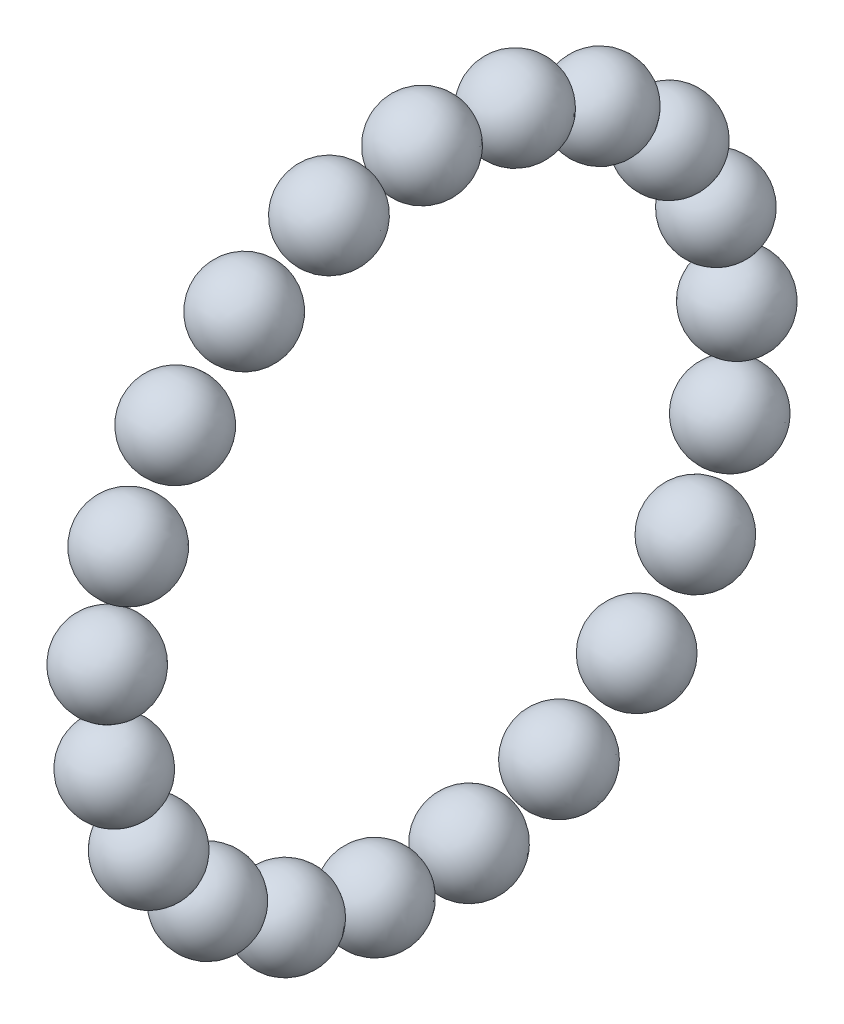
ISO-10303-21;
HEADER;
FILE_DESCRIPTION(('STEP AP214'),'2;1');
FILE_NAME('part.step','',(''),(''),'','','');
FILE_SCHEMA(('AUTOMOTIVE_DESIGN { 1 0 10303 214 1 1 1 1 }'));
ENDSEC;
DATA;
#1=APPLICATION_CONTEXT('core data for automotive mechanical design processes');
#2=APPLICATION_PROTOCOL_DEFINITION('international standard','automotive_design',2000,#1);
#3=PRODUCT_CONTEXT('',#1,'mechanical');
#4=PRODUCT('Part','Part','',(#3));
#5=PRODUCT_RELATED_PRODUCT_CATEGORY('part','',(#4));
#6=PRODUCT_DEFINITION_FORMATION('','',#4);
#7=PRODUCT_DEFINITION_CONTEXT('part definition',#1,'design');
#8=PRODUCT_DEFINITION('design','',#6,#7);
#9=PRODUCT_DEFINITION_SHAPE('','',#8);
#10=(LENGTH_UNIT() NAMED_UNIT(*) SI_UNIT(.MILLI.,.METRE.));
#11=(NAMED_UNIT(*) PLANE_ANGLE_UNIT() SI_UNIT($,.RADIAN.));
#12=(NAMED_UNIT(*) SI_UNIT($,.STERADIAN.) SOLID_ANGLE_UNIT());
#13=UNCERTAINTY_MEASURE_WITH_UNIT(LENGTH_MEASURE(1.E-05),#10,'distance_accuracy_value','');
#14=(GEOMETRIC_REPRESENTATION_CONTEXT(3) GLOBAL_UNCERTAINTY_ASSIGNED_CONTEXT((#13)) GLOBAL_UNIT_ASSIGNED_CONTEXT((#10,
#11,#12)) REPRESENTATION_CONTEXT('',''));
#15=CARTESIAN_POINT('',(0.,0.,0.));
#16=DIRECTION('',(0.,0.,1.));
#17=DIRECTION('',(1.,0.,0.));
#18=AXIS2_PLACEMENT_3D('',#15,#16,#17);
#19=CARTESIAN_POINT('',(0.,12.8067010018979,-8.73146089998614));
#20=DIRECTION('',(0.,0.563320058063622,0.826238774315995));
#21=DIRECTION('',(1.,0.,0.));
#22=AXIS2_PLACEMENT_3D('',#19,#20,#21);
#23=SPHERICAL_SURFACE('',#22,2.1);
#24=CARTESIAN_POINT('',(0.,13.9896731238315,-6.99635947392255));
#25=VERTEX_POINT('',#24);
#26=VERTEX_LOOP('',#25);
#27=FACE_BOUND('',#26,.T.);
#28=ADVANCED_FACE('F13',(#27),#23,.T.);
#29=CLOSED_SHELL('',(#28));
#30=MANIFOLD_SOLID_BREP('B1',#29);
#31=CARTESIAN_POINT('',(0.,5.66278587767913,-14.4285431039852));
#32=DIRECTION('',(0.,0.930873748644204,0.365341024366396));
#33=DIRECTION('',(1.,0.,0.));
#34=AXIS2_PLACEMENT_3D('',#31,#32,#33);
#35=SPHERICAL_SURFACE('',#34,2.1);
#36=CARTESIAN_POINT('',(0.,7.61762074983196,-13.6613269528157));
#37=VERTEX_POINT('',#36);
#38=VERTEX_LOOP('',#37);
#39=FACE_BOUND('',#38,.T.);
#40=ADVANCED_FACE('F21',(#39),#35,.T.);
#41=CLOSED_SHELL('',(#40));
#42=MANIFOLD_SOLID_BREP('B1',#41);
#43=CARTESIAN_POINT('',(0.,-3.44907447632288,-15.1113826388182));
#44=DIRECTION('',(0.,0.974927912181824,-0.222520933956315));
#45=DIRECTION('',(1.,0.,0.));
#46=AXIS2_PLACEMENT_3D('',#43,#44,#45);
#47=SPHERICAL_SURFACE('',#46,2.1);
#48=CARTESIAN_POINT('',(0.,-1.40172586074104,-15.5786766001265));
#49=VERTEX_POINT('',#48);
#50=VERTEX_LOOP('',#49);
#51=FACE_BOUND('',#50,.T.);
#52=ADVANCED_FACE('F31',(#51),#47,.T.);
#53=CLOSED_SHELL('',(#52));
#54=MANIFOLD_SOLID_BREP('B1',#53);
#55=CARTESIAN_POINT('',(0.,-11.3623040133623,-10.5426774354492));
#56=DIRECTION('',(0.,0.68017273777092,-0.733051871829826));
#57=DIRECTION('',(1.,0.,0.));
#58=AXIS2_PLACEMENT_3D('',#55,#56,#57);
#59=SPHERICAL_SURFACE('',#58,2.1);
#60=CARTESIAN_POINT('',(0.,-9.93394126404337,-12.0820863662919));
#61=VERTEX_POINT('',#60);
#62=VERTEX_LOOP('',#61);
#63=FACE_BOUND('',#62,.T.);
#64=ADVANCED_FACE('F35',(#63),#59,.T.);
#65=CLOSED_SHELL('',(#64));
#66=MANIFOLD_SOLID_BREP('B1',#65);
#67=CARTESIAN_POINT('',(0.,-15.3268778064895,-2.3101551257307));
#68=DIRECTION('',(0.,0.149042266176174,-0.988830826225129));
#69=DIRECTION('',(1.,0.,0.));
#70=AXIS2_PLACEMENT_3D('',#67,#68,#69);
#71=SPHERICAL_SURFACE('',#70,2.1);
#72=CARTESIAN_POINT('',(0.,-15.0138890475195,-4.38669986080348));
#73=VERTEX_POINT('',#72);
#74=VERTEX_LOOP('',#73);
#75=FACE_BOUND('',#74,.T.);
#76=ADVANCED_FACE('F40',(#75),#71,.T.);
#77=CLOSED_SHELL('',(#76));
#78=MANIFOLD_SOLID_BREP('B1',#77);
#79=CARTESIAN_POINT('',(0.,-13.9650174524875,6.72519795632215));
#80=DIRECTION('',(0.,-0.433883739117559,-0.900968867902419));
#81=DIRECTION('',(1.,0.,0.));
#82=AXIS2_PLACEMENT_3D('',#79,#80,#81);
#83=SPHERICAL_SURFACE('',#82,2.1);
#84=CARTESIAN_POINT('',(0.,-14.8761733046344,4.83316333372707));
#85=VERTEX_POINT('',#84);
#86=VERTEX_LOOP('',#85);
#87=FACE_BOUND('',#86,.T.);
#88=ADVANCED_FACE('F45',(#87),#83,.T.);
#89=CLOSED_SHELL('',(#88));
#90=MANIFOLD_SOLID_BREP('B1',#89);
#91=CARTESIAN_POINT('',(0.,-7.75,13.4233937586588));
#92=DIRECTION('',(0.,-0.866025403784439,-0.5));
#93=DIRECTION('',(1.,0.,0.));
#94=AXIS2_PLACEMENT_3D('',#91,#92,#93);
#95=SPHERICAL_SURFACE('',#94,2.1);
#96=CARTESIAN_POINT('',(0.,-9.56865334794732,12.3733937586588));
#97=VERTEX_POINT('',#96);
#98=VERTEX_LOOP('',#97);
#99=FACE_BOUND('',#98,.T.);
#100=ADVANCED_FACE('F50',(#99),#95,.T.);
#101=CLOSED_SHELL('',(#100));
#102=MANIFOLD_SOLID_BREP('B1',#101);
#103=CARTESIAN_POINT('',(0.,1.15831645058957,15.4566588563083));
#104=DIRECTION('',(0.,-0.99720379718118,0.0747300935864242));
#105=DIRECTION('',(1.,0.,0.));
#106=AXIS2_PLACEMENT_3D('',#103,#104,#105);
#107=SPHERICAL_SURFACE('',#106,2.1);
#108=CARTESIAN_POINT('',(0.,-0.935811523490904,15.6135920528398));
#109=VERTEX_POINT('',#108);
#110=VERTEX_LOOP('',#109);
#111=FACE_BOUND('',#110,.T.);
#112=ADVANCED_FACE('F55',(#111),#107,.T.);
#113=CLOSED_SHELL('',(#112));
#114=MANIFOLD_SOLID_BREP('B1',#113);
#115=CARTESIAN_POINT('',(0.,9.66409192881037,12.1183879782545));
#116=DIRECTION('',(0.,-0.78183148246803,0.623489801858734));
#117=DIRECTION('',(1.,0.,0.));
#118=AXIS2_PLACEMENT_3D('',#115,#116,#117);
#119=SPHERICAL_SURFACE('',#118,2.1);
#120=CARTESIAN_POINT('',(0.,8.02224581562751,13.4277165621578));
#121=VERTEX_POINT('',#120);
#122=VERTEX_LOOP('',#121);
#123=FACE_BOUND('',#122,.T.);
#124=ADVANCED_FACE('F60',(#123),#119,.T.);
#125=CLOSED_SHELL('',(#124));
#126=MANIFOLD_SOLID_BREP('B1',#125);
#127=CARTESIAN_POINT('',(0.,14.8113784896852,4.56870520336901));
#128=DIRECTION('',(0.,-0.294755174410904,0.955572805786141));
#129=DIRECTION('',(1.,0.,0.));
#130=AXIS2_PLACEMENT_3D('',#127,#128,#129);
#131=SPHERICAL_SURFACE('',#130,2.1);
#132=CARTESIAN_POINT('',(0.,14.1923926234223,6.57540809551991));
#133=VERTEX_POINT('',#132);
#134=VERTEX_LOOP('',#133);
#135=FACE_BOUND('',#134,.T.);
#136=ADVANCED_FACE('F65',(#135),#131,.T.);
#137=CLOSED_SHELL('',(#136));
#138=MANIFOLD_SOLID_BREP('B1',#137);
#139=CARTESIAN_POINT('',(0.,0.,0.));
#140=DIRECTION('',(0.,0.,1.));
#141=DIRECTION('',(1.,0.,0.));
#142=AXIS2_PLACEMENT_3D('',#139,#140,#141);
#143=SPHERICAL_SURFACE('',#142,0.005);
#144=CARTESIAN_POINT('',(0.,0.,0.005));
#145=VERTEX_POINT('',#144);
#146=VERTEX_LOOP('',#145);
#147=FACE_BOUND('',#146,.T.);
#148=ADVANCED_FACE('F70',(#147),#143,.T.);
#149=CLOSED_SHELL('',(#148));
#150=MANIFOLD_SOLID_BREP('B1',#149);
#151=CARTESIAN_POINT('',(0.,15.5,0.));
#152=DIRECTION('',(0.,0.,1.));
#153=DIRECTION('',(1.,0.,0.));
#154=AXIS2_PLACEMENT_3D('',#151,#152,#153);
#155=SPHERICAL_SURFACE('',#154,2.1);
#156=CARTESIAN_POINT('',(0.,15.5,2.1));
#157=VERTEX_POINT('',#156);
#158=VERTEX_LOOP('',#157);
#159=FACE_BOUND('',#158,.T.);
#160=ADVANCED_FACE('F75',(#159),#155,.T.);
#161=CLOSED_SHELL('',(#160));
#162=MANIFOLD_SOLID_BREP('B1',#161);
#163=CARTESIAN_POINT('',(0.,12.8067010018979,8.73146089998614));
#164=DIRECTION('',(0.,-0.563320058063622,0.826238774315995));
#165=DIRECTION('',(1.,0.,0.));
#166=AXIS2_PLACEMENT_3D('',#163,#164,#165);
#167=SPHERICAL_SURFACE('',#166,2.1);
#168=CARTESIAN_POINT('',(0.,11.6237288799643,10.4665623260497));
#169=VERTEX_POINT('',#168);
#170=VERTEX_LOOP('',#169);
#171=FACE_BOUND('',#170,.T.);
#172=ADVANCED_FACE('F80',(#171),#167,.T.);
#173=CLOSED_SHELL('',(#172));
#174=MANIFOLD_SOLID_BREP('B1',#173);
#175=CARTESIAN_POINT('',(0.,5.66278587767912,14.4285431039852));
#176=DIRECTION('',(0.,-0.930873748644204,0.365341024366395));
#177=DIRECTION('',(1.,0.,0.));
#178=AXIS2_PLACEMENT_3D('',#175,#176,#177);
#179=SPHERICAL_SURFACE('',#178,2.1);
#180=CARTESIAN_POINT('',(0.,3.70795100552629,15.1957592551546));
#181=VERTEX_POINT('',#180);
#182=VERTEX_LOOP('',#181);
#183=FACE_BOUND('',#182,.T.);
#184=ADVANCED_FACE('F85',(#183),#179,.T.);
#185=CLOSED_SHELL('',(#184));
#186=MANIFOLD_SOLID_BREP('B1',#185);
#187=CARTESIAN_POINT('',(0.,-3.44907447632287,15.1113826388182));
#188=DIRECTION('',(0.,-0.974927912181824,-0.222520933956315));
#189=DIRECTION('',(1.,0.,0.));
#190=AXIS2_PLACEMENT_3D('',#187,#188,#189);
#191=SPHERICAL_SURFACE('',#190,2.1);
#192=CARTESIAN_POINT('',(0.,-5.4964230919047,14.64408867751));
#193=VERTEX_POINT('',#192);
#194=VERTEX_LOOP('',#193);
#195=FACE_BOUND('',#194,.T.);
#196=ADVANCED_FACE('F90',(#195),#191,.T.);
#197=CLOSED_SHELL('',(#196));
#198=MANIFOLD_SOLID_BREP('B1',#197);
#199=CARTESIAN_POINT('',(0.,-11.3623040133623,10.5426774354492));
#200=DIRECTION('',(0.,-0.680172737770919,-0.733051871829826));
#201=DIRECTION('',(1.,0.,0.));
#202=AXIS2_PLACEMENT_3D('',#199,#200,#201);
#203=SPHERICAL_SURFACE('',#202,2.1);
#204=CARTESIAN_POINT('',(0.,-12.7906667626812,9.00326850460661));
#205=VERTEX_POINT('',#204);
#206=VERTEX_LOOP('',#205);
#207=FACE_BOUND('',#206,.T.);
#208=ADVANCED_FACE('F95',(#207),#203,.T.);
#209=CLOSED_SHELL('',(#208));
#210=MANIFOLD_SOLID_BREP('B1',#209);
#211=CARTESIAN_POINT('',(0.,-15.3268778064895,2.3101551257307));
#212=DIRECTION('',(0.,-0.149042266176174,-0.988830826225129));
#213=DIRECTION('',(1.,0.,0.));
#214=AXIS2_PLACEMENT_3D('',#211,#212,#213);
#215=SPHERICAL_SURFACE('',#214,2.1);
#216=CARTESIAN_POINT('',(0.,-15.6398665654595,0.233610390657929));
#217=VERTEX_POINT('',#216);
#218=VERTEX_LOOP('',#217);
#219=FACE_BOUND('',#218,.T.);
#220=ADVANCED_FACE('F100',(#219),#215,.T.);
#221=CLOSED_SHELL('',(#220));
#222=MANIFOLD_SOLID_BREP('B1',#221);
#223=CARTESIAN_POINT('',(0.,-13.9650174524875,-6.72519795632215));
#224=DIRECTION('',(0.,0.433883739117558,-0.900968867902419));
#225=DIRECTION('',(1.,0.,0.));
#226=AXIS2_PLACEMENT_3D('',#223,#224,#225);
#227=SPHERICAL_SURFACE('',#226,2.1);
#228=CARTESIAN_POINT('',(0.,-13.0538616003406,-8.61723257891723));
#229=VERTEX_POINT('',#228);
#230=VERTEX_LOOP('',#229);
#231=FACE_BOUND('',#230,.T.);
#232=ADVANCED_FACE('F105',(#231),#227,.T.);
#233=CLOSED_SHELL('',(#232));
#234=MANIFOLD_SOLID_BREP('B1',#233);
#235=CARTESIAN_POINT('',(0.,-7.75,-13.4233937586588));
#236=DIRECTION('',(0.,0.866025403784439,-0.5));
#237=DIRECTION('',(1.,0.,0.));
#238=AXIS2_PLACEMENT_3D('',#235,#236,#237);
#239=SPHERICAL_SURFACE('',#238,2.1);
#240=CARTESIAN_POINT('',(0.,-5.93134665205268,-14.4733937586588));
#241=VERTEX_POINT('',#240);
#242=VERTEX_LOOP('',#241);
#243=FACE_BOUND('',#242,.T.);
#244=ADVANCED_FACE('F110',(#243),#239,.T.);
#245=CLOSED_SHELL('',(#244));
#246=MANIFOLD_SOLID_BREP('B1',#245);
#247=CARTESIAN_POINT('',(0.,1.15831645058958,-15.4566588563083));
#248=DIRECTION('',(0.,0.99720379718118,0.0747300935864244));
#249=DIRECTION('',(1.,0.,0.));
#250=AXIS2_PLACEMENT_3D('',#247,#248,#249);
#251=SPHERICAL_SURFACE('',#250,2.1);
#252=CARTESIAN_POINT('',(0.,3.25244442467005,-15.2997256597768));
#253=VERTEX_POINT('',#252);
#254=VERTEX_LOOP('',#253);
#255=FACE_BOUND('',#254,.T.);
#256=ADVANCED_FACE('F115',(#255),#251,.T.);
#257=CLOSED_SHELL('',(#256));
#258=MANIFOLD_SOLID_BREP('B1',#257);
#259=CARTESIAN_POINT('',(0.,9.66409192881037,-12.1183879782545));
#260=DIRECTION('',(0.,0.78183148246803,0.623489801858734));
#261=DIRECTION('',(1.,0.,0.));
#262=AXIS2_PLACEMENT_3D('',#259,#260,#261);
#263=SPHERICAL_SURFACE('',#262,2.1);
#264=CARTESIAN_POINT('',(0.,11.3059380419932,-10.8090593943511));
#265=VERTEX_POINT('',#264);
#266=VERTEX_LOOP('',#265);
#267=FACE_BOUND('',#266,.T.);
#268=ADVANCED_FACE('F119',(#267),#263,.T.);
#269=CLOSED_SHELL('',(#268));
#270=MANIFOLD_SOLID_BREP('B1',#269);
#271=CARTESIAN_POINT('',(0.,14.8113784896852,-4.56870520336901));
#272=DIRECTION('',(0.,0.294755174410904,0.955572805786141));
#273=DIRECTION('',(1.,0.,0.));
#274=AXIS2_PLACEMENT_3D('',#271,#272,#273);
#275=SPHERICAL_SURFACE('',#274,2.1);
#276=CARTESIAN_POINT('',(0.,15.4303643559481,-2.56200231121811));
#277=VERTEX_POINT('',#276);
#278=VERTEX_LOOP('',#277);
#279=FACE_BOUND('',#278,.T.);
#280=ADVANCED_FACE('F15',(#279),#275,.T.);
#281=CLOSED_SHELL('',(#280));
#282=MANIFOLD_SOLID_BREP('B1',#281);
#283=ADVANCED_BREP_SHAPE_REPRESENTATION('',(#18,#30,#42,#54,#66,#78,#90,#102,#114,#126,#138,
#150,#162,#174,#186,#198,#210,#222,#234,#246,#258,#270,#282),#14);
#284=SHAPE_DEFINITION_REPRESENTATION(#9,#283);
ENDSEC;
END-ISO-10303-21;
